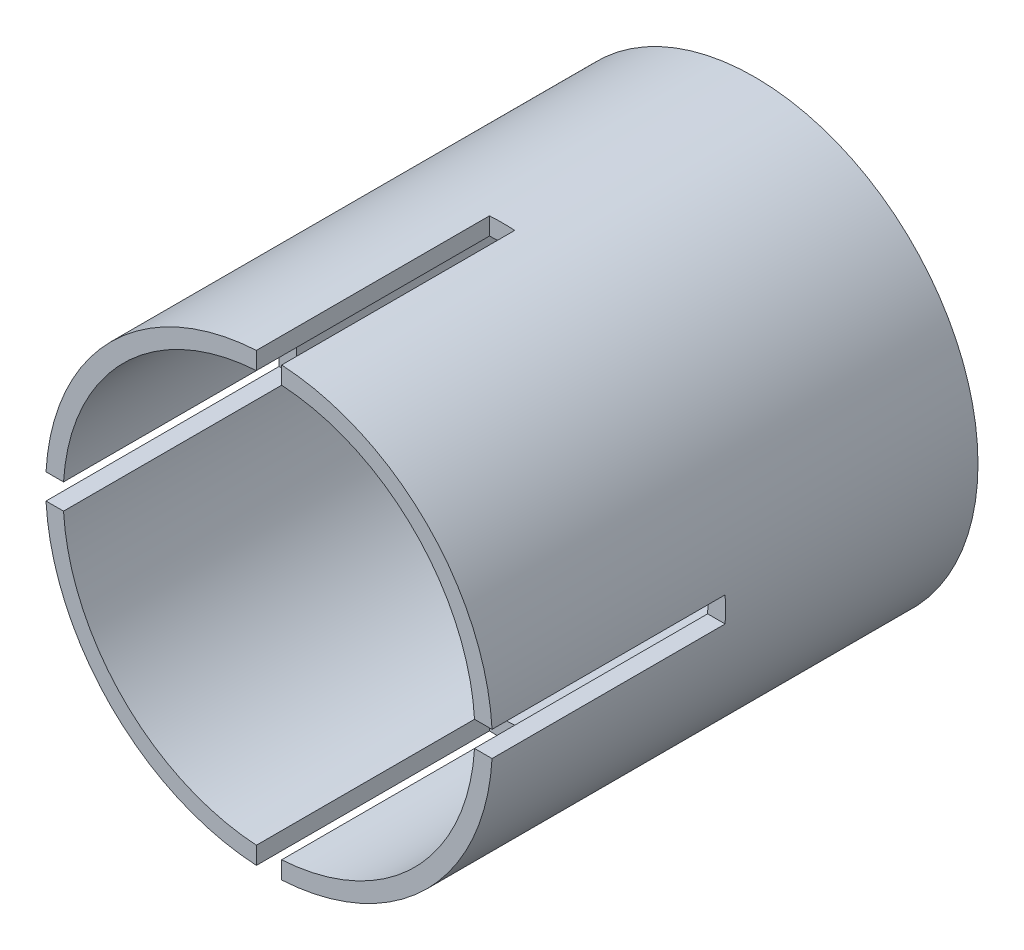
ISO-10303-21;
HEADER;
FILE_DESCRIPTION(('STEP AP214'),'2;1');
FILE_NAME('part.step','',(''),(''),'','','');
FILE_SCHEMA(('AUTOMOTIVE_DESIGN { 1 0 10303 214 1 1 1 1 }'));
ENDSEC;
DATA;
#1=APPLICATION_CONTEXT('core data for automotive mechanical design processes');
#2=APPLICATION_PROTOCOL_DEFINITION('international standard','automotive_design',2000,#1);
#3=PRODUCT_CONTEXT('',#1,'mechanical');
#4=PRODUCT('Part','Part','',(#3));
#5=PRODUCT_RELATED_PRODUCT_CATEGORY('part','',(#4));
#6=PRODUCT_DEFINITION_FORMATION('','',#4);
#7=PRODUCT_DEFINITION_CONTEXT('part definition',#1,'design');
#8=PRODUCT_DEFINITION('design','',#6,#7);
#9=PRODUCT_DEFINITION_SHAPE('','',#8);
#10=(LENGTH_UNIT() NAMED_UNIT(*) SI_UNIT(.MILLI.,.METRE.));
#11=(NAMED_UNIT(*) PLANE_ANGLE_UNIT() SI_UNIT($,.RADIAN.));
#12=(NAMED_UNIT(*) SI_UNIT($,.STERADIAN.) SOLID_ANGLE_UNIT());
#13=UNCERTAINTY_MEASURE_WITH_UNIT(LENGTH_MEASURE(1.E-05),#10,'distance_accuracy_value','');
#14=(GEOMETRIC_REPRESENTATION_CONTEXT(3) GLOBAL_UNCERTAINTY_ASSIGNED_CONTEXT((#13)) GLOBAL_UNIT_ASSIGNED_CONTEXT((#10,
#11,#12)) REPRESENTATION_CONTEXT('',''));
#15=CARTESIAN_POINT('',(0.,0.,0.));
#16=DIRECTION('',(0.,0.,1.));
#17=DIRECTION('',(1.,0.,0.));
#18=AXIS2_PLACEMENT_3D('',#15,#16,#17);
#19=CARTESIAN_POINT('',(0.,0.,25.));
#20=DIRECTION('',(0.,0.,1.));
#21=DIRECTION('',(1.,0.,0.));
#22=AXIS2_PLACEMENT_3D('',#19,#20,#21);
#23=PLANE('',#22);
#24=DIRECTION('',(0.,1.,0.));
#25=VECTOR('',#24,1.);
#26=CARTESIAN_POINT('',(0.650000000000136,-13.,25.));
#27=LINE('',#26,#25);
#28=CARTESIAN_POINT('',(0.65000000000012,-11.4816157399558,25.));
#29=VERTEX_POINT('',#28);
#30=CARTESIAN_POINT('',(0.650000000000111,-10.5800519847494,25.));
#31=VERTEX_POINT('',#30);
#32=EDGE_CURVE('E161',#29,#31,#27,.T.);
#33=ORIENTED_EDGE('',*,*,#32,.F.);
#34=CARTESIAN_POINT('',(0.,0.,25.));
#35=DIRECTION('',(0.,0.,1.));
#36=DIRECTION('',(1.,0.,0.));
#37=AXIS2_PLACEMENT_3D('',#34,#35,#36);
#38=CIRCLE('',#37,11.5);
#39=CARTESIAN_POINT('',(11.4816157399558,-0.65,25.));
#40=VERTEX_POINT('',#39);
#41=EDGE_CURVE('E185',#29,#40,#38,.T.);
#42=ORIENTED_EDGE('',*,*,#41,.T.);
#43=DIRECTION('',(1.,0.,0.));
#44=VECTOR('',#43,1.);
#45=CARTESIAN_POINT('',(13.,-0.65,25.));
#46=LINE('',#45,#44);
#47=CARTESIAN_POINT('',(10.5800519847494,-0.65,25.));
#48=VERTEX_POINT('',#47);
#49=EDGE_CURVE('E262',#48,#40,#46,.T.);
#50=ORIENTED_EDGE('',*,*,#49,.F.);
#51=CARTESIAN_POINT('',(0.,0.,25.));
#52=DIRECTION('',(0.,0.,1.));
#53=DIRECTION('',(1.,0.,0.));
#54=AXIS2_PLACEMENT_3D('',#51,#52,#53);
#55=CIRCLE('',#54,10.6);
#56=EDGE_CURVE('E170',#31,#48,#55,.T.);
#57=ORIENTED_EDGE('',*,*,#56,.F.);
#58=EDGE_LOOP('',(#33,#42,#50,#57));
#59=FACE_BOUND('',#58,.T.);
#60=ADVANCED_FACE('F31',(#59),#23,.T.);
#61=DIRECTION('',(0.,-1.,0.));
#62=VECTOR('',#61,1.);
#63=CARTESIAN_POINT('',(-0.649999999999864,-13.,25.));
#64=LINE('',#63,#62);
#65=CARTESIAN_POINT('',(-0.649999999999889,-10.5800519847494,25.));
#66=VERTEX_POINT('',#65);
#67=CARTESIAN_POINT('',(-0.64999999999988,-11.4816157399558,25.));
#68=VERTEX_POINT('',#67);
#69=EDGE_CURVE('E145',#66,#68,#64,.T.);
#70=ORIENTED_EDGE('',*,*,#69,.F.);
#71=CARTESIAN_POINT('',(-10.5800519847494,-0.65,25.));
#72=VERTEX_POINT('',#71);
#73=EDGE_CURVE('E158',#72,#66,#55,.T.);
#74=ORIENTED_EDGE('',*,*,#73,.F.);
#75=DIRECTION('',(1.,0.,0.));
#76=VECTOR('',#75,1.);
#77=CARTESIAN_POINT('',(-13.,-0.65,25.));
#78=LINE('',#77,#76);
#79=CARTESIAN_POINT('',(-11.4816157399558,-0.65,25.));
#80=VERTEX_POINT('',#79);
#81=EDGE_CURVE('E233',#80,#72,#78,.T.);
#82=ORIENTED_EDGE('',*,*,#81,.F.);
#83=EDGE_CURVE('E160',#80,#68,#38,.T.);
#84=ORIENTED_EDGE('',*,*,#83,.T.);
#85=EDGE_LOOP('',(#70,#74,#82,#84));
#86=FACE_BOUND('',#85,.T.);
#87=ADVANCED_FACE('F156',(#86),#23,.T.);
#88=DIRECTION('',(-1.,0.,0.));
#89=VECTOR('',#88,1.);
#90=CARTESIAN_POINT('',(-13.,0.65,25.));
#91=LINE('',#90,#89);
#92=CARTESIAN_POINT('',(-10.5800519847494,0.65,25.));
#93=VERTEX_POINT('',#92);
#94=CARTESIAN_POINT('',(-11.4816157399558,0.65,25.));
#95=VERTEX_POINT('',#94);
#96=EDGE_CURVE('E229',#93,#95,#91,.T.);
#97=ORIENTED_EDGE('',*,*,#96,.F.);
#98=CARTESIAN_POINT('',(-0.650000000000037,10.5800519847494,25.));
#99=VERTEX_POINT('',#98);
#100=EDGE_CURVE('E169',#99,#93,#55,.T.);
#101=ORIENTED_EDGE('',*,*,#100,.F.);
#102=DIRECTION('',(0.,-1.,0.));
#103=VECTOR('',#102,1.);
#104=CARTESIAN_POINT('',(-0.650000000000046,13.,25.));
#105=LINE('',#104,#103);
#106=CARTESIAN_POINT('',(-0.65000000000004,11.4816157399558,25.));
#107=VERTEX_POINT('',#106);
#108=EDGE_CURVE('E250',#107,#99,#105,.T.);
#109=ORIENTED_EDGE('',*,*,#108,.F.);
#110=EDGE_CURVE('E184',#107,#95,#38,.T.);
#111=ORIENTED_EDGE('',*,*,#110,.T.);
#112=EDGE_LOOP('',(#97,#101,#109,#111));
#113=FACE_BOUND('',#112,.T.);
#114=ADVANCED_FACE('F302',(#113),#23,.T.);
#115=DIRECTION('',(0.,1.,0.));
#116=VECTOR('',#115,1.);
#117=CARTESIAN_POINT('',(0.649999999999954,13.,25.));
#118=LINE('',#117,#116);
#119=CARTESIAN_POINT('',(0.649999999999963,10.5800519847494,25.));
#120=VERTEX_POINT('',#119);
#121=CARTESIAN_POINT('',(0.64999999999996,11.4816157399558,25.));
#122=VERTEX_POINT('',#121);
#123=EDGE_CURVE('E245',#120,#122,#118,.T.);
#124=ORIENTED_EDGE('',*,*,#123,.F.);
#125=CARTESIAN_POINT('',(10.5800519847494,0.65,25.));
#126=VERTEX_POINT('',#125);
#127=EDGE_CURVE('E173',#126,#120,#55,.T.);
#128=ORIENTED_EDGE('',*,*,#127,.F.);
#129=DIRECTION('',(-1.,0.,0.));
#130=VECTOR('',#129,1.);
#131=CARTESIAN_POINT('',(13.,0.65,25.));
#132=LINE('',#131,#130);
#133=CARTESIAN_POINT('',(11.4816157399558,0.65,25.));
#134=VERTEX_POINT('',#133);
#135=EDGE_CURVE('E267',#134,#126,#132,.T.);
#136=ORIENTED_EDGE('',*,*,#135,.F.);
#137=EDGE_CURVE('E180',#134,#122,#38,.T.);
#138=ORIENTED_EDGE('',*,*,#137,.T.);
#139=EDGE_LOOP('',(#124,#128,#136,#138));
#140=FACE_BOUND('',#139,.T.);
#141=ADVANCED_FACE('F286',(#140),#23,.T.);
#142=CARTESIAN_POINT('',(0.,0.,0.));
#143=DIRECTION('',(0.,0.,1.));
#144=DIRECTION('',(1.,0.,0.));
#145=AXIS2_PLACEMENT_3D('',#142,#143,#144);
#146=PLANE('',#145);
#147=CARTESIAN_POINT('',(0.,0.,0.));
#148=DIRECTION('',(0.,0.,1.));
#149=DIRECTION('',(1.,0.,0.));
#150=AXIS2_PLACEMENT_3D('',#147,#148,#149);
#151=CIRCLE('',#150,11.5);
#152=CARTESIAN_POINT('',(11.5,0.,0.));
#153=VERTEX_POINT('',#152);
#154=EDGE_CURVE('E178',#153,#153,#151,.T.);
#155=ORIENTED_EDGE('',*,*,#154,.F.);
#156=EDGE_LOOP('',(#155));
#157=FACE_BOUND('',#156,.T.);
#158=ADVANCED_FACE('F337',(#157),#146,.F.);
#159=CARTESIAN_POINT('',(0.,0.,25.));
#160=DIRECTION('',(0.,0.,-1.));
#161=DIRECTION('',(-1.,0.,0.));
#162=AXIS2_PLACEMENT_3D('',#159,#160,#161);
#163=CYLINDRICAL_SURFACE('',#162,11.5);
#164=ORIENTED_EDGE('',*,*,#41,.F.);
#165=DIRECTION('',(0.,0.,-1.));
#166=VECTOR('',#165,1.);
#167=CARTESIAN_POINT('',(0.65000000000012,-11.4816157399558,25.));
#168=LINE('',#167,#166);
#169=CARTESIAN_POINT('',(0.65000000000012,-11.4816157399558,13.));
#170=VERTEX_POINT('',#169);
#171=EDGE_CURVE('E222',#29,#170,#168,.T.);
#172=ORIENTED_EDGE('',*,*,#171,.T.);
#173=CARTESIAN_POINT('',(0.,0.,13.));
#174=DIRECTION('',(0.,0.,1.));
#175=DIRECTION('',(1.,0.,0.));
#176=AXIS2_PLACEMENT_3D('',#173,#174,#175);
#177=CIRCLE('',#176,11.5);
#178=CARTESIAN_POINT('',(-0.64999999999988,-11.4816157399558,13.));
#179=VERTEX_POINT('',#178);
#180=EDGE_CURVE('E215',#179,#170,#177,.T.);
#181=ORIENTED_EDGE('',*,*,#180,.F.);
#182=DIRECTION('',(0.,0.,-1.));
#183=VECTOR('',#182,1.);
#184=CARTESIAN_POINT('',(-0.64999999999988,-11.4816157399558,25.));
#185=LINE('',#184,#183);
#186=EDGE_CURVE('E221',#179,#68,#185,.F.);
#187=ORIENTED_EDGE('',*,*,#186,.T.);
#188=ORIENTED_EDGE('',*,*,#83,.F.);
#189=DIRECTION('',(0.,0.,-1.));
#190=VECTOR('',#189,1.);
#191=CARTESIAN_POINT('',(-11.4816157399558,-0.65,25.));
#192=LINE('',#191,#190);
#193=CARTESIAN_POINT('',(-11.4816157399558,-0.65,13.));
#194=VERTEX_POINT('',#193);
#195=EDGE_CURVE('E242',#80,#194,#192,.T.);
#196=ORIENTED_EDGE('',*,*,#195,.T.);
#197=CARTESIAN_POINT('',(0.,0.,13.));
#198=DIRECTION('',(0.,0.,1.));
#199=DIRECTION('',(1.,0.,0.));
#200=AXIS2_PLACEMENT_3D('',#197,#198,#199);
#201=CIRCLE('',#200,11.5);
#202=CARTESIAN_POINT('',(-11.4816157399558,0.65,13.));
#203=VERTEX_POINT('',#202);
#204=EDGE_CURVE('E235',#203,#194,#201,.T.);
#205=ORIENTED_EDGE('',*,*,#204,.F.);
#206=DIRECTION('',(0.,0.,-1.));
#207=VECTOR('',#206,1.);
#208=CARTESIAN_POINT('',(-11.4816157399558,0.65,25.));
#209=LINE('',#208,#207);
#210=EDGE_CURVE('E239',#203,#95,#209,.F.);
#211=ORIENTED_EDGE('',*,*,#210,.T.);
#212=ORIENTED_EDGE('',*,*,#110,.F.);
#213=DIRECTION('',(0.,0.,-1.));
#214=VECTOR('',#213,1.);
#215=CARTESIAN_POINT('',(-0.65000000000004,11.4816157399558,25.));
#216=LINE('',#215,#214);
#217=CARTESIAN_POINT('',(-0.65000000000004,11.4816157399558,13.));
#218=VERTEX_POINT('',#217);
#219=EDGE_CURVE('E259',#107,#218,#216,.T.);
#220=ORIENTED_EDGE('',*,*,#219,.T.);
#221=CARTESIAN_POINT('',(0.,0.,13.));
#222=DIRECTION('',(0.,0.,1.));
#223=DIRECTION('',(1.,0.,0.));
#224=AXIS2_PLACEMENT_3D('',#221,#222,#223);
#225=CIRCLE('',#224,11.5);
#226=CARTESIAN_POINT('',(0.64999999999996,11.4816157399558,13.));
#227=VERTEX_POINT('',#226);
#228=EDGE_CURVE('E252',#227,#218,#225,.T.);
#229=ORIENTED_EDGE('',*,*,#228,.F.);
#230=DIRECTION('',(0.,0.,-1.));
#231=VECTOR('',#230,1.);
#232=CARTESIAN_POINT('',(0.64999999999996,11.4816157399558,25.));
#233=LINE('',#232,#231);
#234=EDGE_CURVE('E256',#227,#122,#233,.F.);
#235=ORIENTED_EDGE('',*,*,#234,.T.);
#236=ORIENTED_EDGE('',*,*,#137,.F.);
#237=DIRECTION('',(0.,0.,-1.));
#238=VECTOR('',#237,1.);
#239=CARTESIAN_POINT('',(11.4816157399558,0.65,25.));
#240=LINE('',#239,#238);
#241=CARTESIAN_POINT('',(11.4816157399558,0.65,13.));
#242=VERTEX_POINT('',#241);
#243=EDGE_CURVE('E174',#134,#242,#240,.T.);
#244=ORIENTED_EDGE('',*,*,#243,.T.);
#245=CARTESIAN_POINT('',(0.,0.,13.));
#246=DIRECTION('',(0.,0.,1.));
#247=DIRECTION('',(1.,0.,0.));
#248=AXIS2_PLACEMENT_3D('',#245,#246,#247);
#249=CIRCLE('',#248,11.5);
#250=CARTESIAN_POINT('',(11.4816157399558,-0.65,13.));
#251=VERTEX_POINT('',#250);
#252=EDGE_CURVE('E269',#251,#242,#249,.T.);
#253=ORIENTED_EDGE('',*,*,#252,.F.);
#254=DIRECTION('',(0.,0.,-1.));
#255=VECTOR('',#254,1.);
#256=CARTESIAN_POINT('',(11.4816157399558,-0.65,25.));
#257=LINE('',#256,#255);
#258=EDGE_CURVE('E273',#251,#40,#257,.F.);
#259=ORIENTED_EDGE('',*,*,#258,.T.);
#260=EDGE_LOOP('',(#164,#172,#181,#187,#188,#196,#205,#211,#212,#220,#229,#235,#236,#244,#253,#259));
#261=FACE_BOUND('',#260,.T.);
#262=ORIENTED_EDGE('',*,*,#154,.T.);
#263=EDGE_LOOP('',(#262));
#264=FACE_BOUND('',#263,.T.);
#265=ADVANCED_FACE('F33',(#261,#264),#163,.T.);
#266=CARTESIAN_POINT('',(0.,0.,25.));
#267=DIRECTION('',(0.,0.,-1.));
#268=DIRECTION('',(-1.,0.,0.));
#269=AXIS2_PLACEMENT_3D('',#266,#267,#268);
#270=CYLINDRICAL_SURFACE('',#269,10.6);
#271=DIRECTION('',(0.,0.,-1.));
#272=VECTOR('',#271,1.);
#273=CARTESIAN_POINT('',(0.650000000000111,-10.5800519847494,25.));
#274=LINE('',#273,#272);
#275=CARTESIAN_POINT('',(0.650000000000111,-10.5800519847494,13.));
#276=VERTEX_POINT('',#275);
#277=EDGE_CURVE('E11',#31,#276,#274,.T.);
#278=ORIENTED_EDGE('',*,*,#277,.F.);
#279=ORIENTED_EDGE('',*,*,#56,.T.);
#280=DIRECTION('',(0.,0.,-1.));
#281=VECTOR('',#280,1.);
#282=CARTESIAN_POINT('',(10.5800519847494,-0.65,25.));
#283=LINE('',#282,#281);
#284=CARTESIAN_POINT('',(10.5800519847494,-0.65,13.));
#285=VERTEX_POINT('',#284);
#286=EDGE_CURVE('E193',#285,#48,#283,.F.);
#287=ORIENTED_EDGE('',*,*,#286,.F.);
#288=CARTESIAN_POINT('',(0.,0.,13.));
#289=DIRECTION('',(0.,0.,1.));
#290=DIRECTION('',(1.,0.,0.));
#291=AXIS2_PLACEMENT_3D('',#288,#289,#290);
#292=CIRCLE('',#291,10.6);
#293=CARTESIAN_POINT('',(10.5800519847494,0.65,13.));
#294=VERTEX_POINT('',#293);
#295=EDGE_CURVE('E190',#285,#294,#292,.T.);
#296=ORIENTED_EDGE('',*,*,#295,.T.);
#297=DIRECTION('',(0.,0.,-1.));
#298=VECTOR('',#297,1.);
#299=CARTESIAN_POINT('',(10.5800519847494,0.65,25.));
#300=LINE('',#299,#298);
#301=EDGE_CURVE('E196',#126,#294,#300,.T.);
#302=ORIENTED_EDGE('',*,*,#301,.F.);
#303=ORIENTED_EDGE('',*,*,#127,.T.);
#304=DIRECTION('',(0.,0.,-1.));
#305=VECTOR('',#304,1.);
#306=CARTESIAN_POINT('',(0.649999999999963,10.5800519847494,25.));
#307=LINE('',#306,#305);
#308=CARTESIAN_POINT('',(0.649999999999963,10.5800519847494,13.));
#309=VERTEX_POINT('',#308);
#310=EDGE_CURVE('E202',#309,#120,#307,.F.);
#311=ORIENTED_EDGE('',*,*,#310,.F.);
#312=CARTESIAN_POINT('',(0.,0.,13.));
#313=DIRECTION('',(0.,0.,1.));
#314=DIRECTION('',(1.,0.,0.));
#315=AXIS2_PLACEMENT_3D('',#312,#313,#314);
#316=CIRCLE('',#315,10.6);
#317=CARTESIAN_POINT('',(-0.650000000000037,10.5800519847494,13.));
#318=VERTEX_POINT('',#317);
#319=EDGE_CURVE('E199',#309,#318,#316,.T.);
#320=ORIENTED_EDGE('',*,*,#319,.T.);
#321=DIRECTION('',(0.,0.,-1.));
#322=VECTOR('',#321,1.);
#323=CARTESIAN_POINT('',(-0.650000000000037,10.5800519847494,25.));
#324=LINE('',#323,#322);
#325=EDGE_CURVE('E204',#99,#318,#324,.T.);
#326=ORIENTED_EDGE('',*,*,#325,.F.);
#327=ORIENTED_EDGE('',*,*,#100,.T.);
#328=DIRECTION('',(0.,0.,-1.));
#329=VECTOR('',#328,1.);
#330=CARTESIAN_POINT('',(-10.5800519847494,0.65,25.));
#331=LINE('',#330,#329);
#332=CARTESIAN_POINT('',(-10.5800519847494,0.65,13.));
#333=VERTEX_POINT('',#332);
#334=EDGE_CURVE('E209',#333,#93,#331,.F.);
#335=ORIENTED_EDGE('',*,*,#334,.F.);
#336=CARTESIAN_POINT('',(0.,0.,13.));
#337=DIRECTION('',(0.,0.,1.));
#338=DIRECTION('',(1.,0.,0.));
#339=AXIS2_PLACEMENT_3D('',#336,#337,#338);
#340=CIRCLE('',#339,10.6);
#341=CARTESIAN_POINT('',(-10.5800519847494,-0.65,13.));
#342=VERTEX_POINT('',#341);
#343=EDGE_CURVE('E207',#333,#342,#340,.T.);
#344=ORIENTED_EDGE('',*,*,#343,.T.);
#345=DIRECTION('',(0.,0.,-1.));
#346=VECTOR('',#345,1.);
#347=CARTESIAN_POINT('',(-10.5800519847494,-0.65,25.));
#348=LINE('',#347,#346);
#349=EDGE_CURVE('E168',#72,#342,#348,.T.);
#350=ORIENTED_EDGE('',*,*,#349,.F.);
#351=ORIENTED_EDGE('',*,*,#73,.T.);
#352=DIRECTION('',(0.,0.,-1.));
#353=VECTOR('',#352,1.);
#354=CARTESIAN_POINT('',(-0.649999999999889,-10.5800519847494,25.));
#355=LINE('',#354,#353);
#356=CARTESIAN_POINT('',(-0.649999999999889,-10.5800519847494,13.));
#357=VERTEX_POINT('',#356);
#358=EDGE_CURVE('E39',#357,#66,#355,.F.);
#359=ORIENTED_EDGE('',*,*,#358,.F.);
#360=CARTESIAN_POINT('',(0.,0.,13.));
#361=DIRECTION('',(0.,0.,1.));
#362=DIRECTION('',(1.,0.,0.));
#363=AXIS2_PLACEMENT_3D('',#360,#361,#362);
#364=CIRCLE('',#363,10.6);
#365=EDGE_CURVE('E152',#357,#276,#364,.T.);
#366=ORIENTED_EDGE('',*,*,#365,.T.);
#367=EDGE_LOOP('',(#278,#279,#287,#296,#302,#303,#311,#320,#326,#327,#335,#344,#350,#351,#359,#366));
#368=FACE_BOUND('',#367,.T.);
#369=CARTESIAN_POINT('',(0.,0.,1.));
#370=DIRECTION('',(0.,0.,1.));
#371=DIRECTION('',(1.,0.,0.));
#372=AXIS2_PLACEMENT_3D('',#369,#370,#371);
#373=CIRCLE('',#372,10.6);
#374=CARTESIAN_POINT('',(10.6,0.,1.));
#375=VERTEX_POINT('',#374);
#376=EDGE_CURVE('E183',#375,#375,#373,.T.);
#377=ORIENTED_EDGE('',*,*,#376,.F.);
#378=EDGE_LOOP('',(#377));
#379=FACE_BOUND('',#378,.T.);
#380=ADVANCED_FACE('F165',(#368,#379),#270,.F.);
#381=CARTESIAN_POINT('',(0.,0.,1.));
#382=DIRECTION('',(0.,0.,1.));
#383=DIRECTION('',(1.,0.,0.));
#384=AXIS2_PLACEMENT_3D('',#381,#382,#383);
#385=PLANE('',#384);
#386=ORIENTED_EDGE('',*,*,#376,.T.);
#387=EDGE_LOOP('',(#386));
#388=FACE_BOUND('',#387,.T.);
#389=ADVANCED_FACE('F378',(#388),#385,.T.);
#390=CARTESIAN_POINT('',(13.,0.65,13.));
#391=DIRECTION('',(0.,1.,0.));
#392=DIRECTION('',(-1.,0.,0.));
#393=AXIS2_PLACEMENT_3D('',#390,#391,#392);
#394=PLANE('',#393);
#395=ORIENTED_EDGE('',*,*,#135,.T.);
#396=ORIENTED_EDGE('',*,*,#301,.T.);
#397=DIRECTION('',(-1.,0.,0.));
#398=VECTOR('',#397,1.);
#399=CARTESIAN_POINT('',(13.,0.65,13.));
#400=LINE('',#399,#398);
#401=EDGE_CURVE('E266',#242,#294,#400,.T.);
#402=ORIENTED_EDGE('',*,*,#401,.F.);
#403=ORIENTED_EDGE('',*,*,#243,.F.);
#404=EDGE_LOOP('',(#395,#396,#402,#403));
#405=FACE_BOUND('',#404,.T.);
#406=ADVANCED_FACE('F281',(#405),#394,.F.);
#407=CARTESIAN_POINT('',(13.,-0.65,13.));
#408=DIRECTION('',(0.,-1.,0.));
#409=DIRECTION('',(1.,0.,0.));
#410=AXIS2_PLACEMENT_3D('',#407,#408,#409);
#411=PLANE('',#410);
#412=DIRECTION('',(1.,0.,0.));
#413=VECTOR('',#412,1.);
#414=CARTESIAN_POINT('',(13.,-0.65,13.));
#415=LINE('',#414,#413);
#416=EDGE_CURVE('E263',#285,#251,#415,.T.);
#417=ORIENTED_EDGE('',*,*,#416,.F.);
#418=ORIENTED_EDGE('',*,*,#286,.T.);
#419=ORIENTED_EDGE('',*,*,#49,.T.);
#420=ORIENTED_EDGE('',*,*,#258,.F.);
#421=EDGE_LOOP('',(#417,#418,#419,#420));
#422=FACE_BOUND('',#421,.T.);
#423=ADVANCED_FACE('F293',(#422),#411,.F.);
#424=CARTESIAN_POINT('',(10.,0.65,13.));
#425=DIRECTION('',(0.,0.,1.));
#426=DIRECTION('',(1.,0.,0.));
#427=AXIS2_PLACEMENT_3D('',#424,#425,#426);
#428=PLANE('',#427);
#429=ORIENTED_EDGE('',*,*,#252,.T.);
#430=ORIENTED_EDGE('',*,*,#401,.T.);
#431=ORIENTED_EDGE('',*,*,#295,.F.);
#432=ORIENTED_EDGE('',*,*,#416,.T.);
#433=EDGE_LOOP('',(#429,#430,#431,#432));
#434=FACE_BOUND('',#433,.T.);
#435=ADVANCED_FACE('F291',(#434),#428,.T.);
#436=CARTESIAN_POINT('',(-0.650000000000046,13.,13.));
#437=DIRECTION('',(-1.,0.,0.));
#438=DIRECTION('',(0.,-1.,0.));
#439=AXIS2_PLACEMENT_3D('',#436,#437,#438);
#440=PLANE('',#439);
#441=ORIENTED_EDGE('',*,*,#108,.T.);
#442=ORIENTED_EDGE('',*,*,#325,.T.);
#443=DIRECTION('',(0.,-1.,0.));
#444=VECTOR('',#443,1.);
#445=CARTESIAN_POINT('',(-0.650000000000046,13.,13.));
#446=LINE('',#445,#444);
#447=EDGE_CURVE('E249',#218,#318,#446,.T.);
#448=ORIENTED_EDGE('',*,*,#447,.F.);
#449=ORIENTED_EDGE('',*,*,#219,.F.);
#450=EDGE_LOOP('',(#441,#442,#448,#449));
#451=FACE_BOUND('',#450,.T.);
#452=ADVANCED_FACE('F314',(#451),#440,.F.);
#453=CARTESIAN_POINT('',(0.649999999999954,13.,13.));
#454=DIRECTION('',(1.,0.,0.));
#455=DIRECTION('',(0.,1.,0.));
#456=AXIS2_PLACEMENT_3D('',#453,#454,#455);
#457=PLANE('',#456);
#458=DIRECTION('',(0.,1.,0.));
#459=VECTOR('',#458,1.);
#460=CARTESIAN_POINT('',(0.649999999999954,13.,13.));
#461=LINE('',#460,#459);
#462=EDGE_CURVE('E246',#309,#227,#461,.T.);
#463=ORIENTED_EDGE('',*,*,#462,.F.);
#464=ORIENTED_EDGE('',*,*,#310,.T.);
#465=ORIENTED_EDGE('',*,*,#123,.T.);
#466=ORIENTED_EDGE('',*,*,#234,.F.);
#467=EDGE_LOOP('',(#463,#464,#465,#466));
#468=FACE_BOUND('',#467,.T.);
#469=ADVANCED_FACE('F319',(#468),#457,.F.);
#470=CARTESIAN_POINT('',(-0.650000000000035,10.,13.));
#471=DIRECTION('',(0.,0.,1.));
#472=DIRECTION('',(0.,1.,0.));
#473=AXIS2_PLACEMENT_3D('',#470,#471,#472);
#474=PLANE('',#473);
#475=ORIENTED_EDGE('',*,*,#228,.T.);
#476=ORIENTED_EDGE('',*,*,#447,.T.);
#477=ORIENTED_EDGE('',*,*,#319,.F.);
#478=ORIENTED_EDGE('',*,*,#462,.T.);
#479=EDGE_LOOP('',(#475,#476,#477,#478));
#480=FACE_BOUND('',#479,.T.);
#481=ADVANCED_FACE('F316',(#480),#474,.T.);
#482=CARTESIAN_POINT('',(-13.,-0.65,13.));
#483=DIRECTION('',(0.,-1.,0.));
#484=DIRECTION('',(1.,0.,0.));
#485=AXIS2_PLACEMENT_3D('',#482,#483,#484);
#486=PLANE('',#485);
#487=ORIENTED_EDGE('',*,*,#81,.T.);
#488=ORIENTED_EDGE('',*,*,#349,.T.);
#489=DIRECTION('',(1.,0.,0.));
#490=VECTOR('',#489,1.);
#491=CARTESIAN_POINT('',(-13.,-0.65,13.));
#492=LINE('',#491,#490);
#493=EDGE_CURVE('E53',#194,#342,#492,.T.);
#494=ORIENTED_EDGE('',*,*,#493,.F.);
#495=ORIENTED_EDGE('',*,*,#195,.F.);
#496=EDGE_LOOP('',(#487,#488,#494,#495));
#497=FACE_BOUND('',#496,.T.);
#498=ADVANCED_FACE('F326',(#497),#486,.F.);
#499=CARTESIAN_POINT('',(-13.,0.65,13.));
#500=DIRECTION('',(0.,1.,0.));
#501=DIRECTION('',(-1.,0.,0.));
#502=AXIS2_PLACEMENT_3D('',#499,#500,#501);
#503=PLANE('',#502);
#504=DIRECTION('',(-1.,0.,0.));
#505=VECTOR('',#504,1.);
#506=CARTESIAN_POINT('',(-13.,0.65,13.));
#507=LINE('',#506,#505);
#508=EDGE_CURVE('E230',#333,#203,#507,.T.);
#509=ORIENTED_EDGE('',*,*,#508,.F.);
#510=ORIENTED_EDGE('',*,*,#334,.T.);
#511=ORIENTED_EDGE('',*,*,#96,.T.);
#512=ORIENTED_EDGE('',*,*,#210,.F.);
#513=EDGE_LOOP('',(#509,#510,#511,#512));
#514=FACE_BOUND('',#513,.T.);
#515=ADVANCED_FACE('F308',(#514),#503,.F.);
#516=CARTESIAN_POINT('',(-10.,-0.65,13.));
#517=DIRECTION('',(0.,0.,1.));
#518=DIRECTION('',(-1.,0.,0.));
#519=AXIS2_PLACEMENT_3D('',#516,#517,#518);
#520=PLANE('',#519);
#521=ORIENTED_EDGE('',*,*,#204,.T.);
#522=ORIENTED_EDGE('',*,*,#493,.T.);
#523=ORIENTED_EDGE('',*,*,#343,.F.);
#524=ORIENTED_EDGE('',*,*,#508,.T.);
#525=EDGE_LOOP('',(#521,#522,#523,#524));
#526=FACE_BOUND('',#525,.T.);
#527=ADVANCED_FACE('F310',(#526),#520,.T.);
#528=CARTESIAN_POINT('',(0.650000000000136,-13.,13.));
#529=DIRECTION('',(1.,0.,0.));
#530=DIRECTION('',(0.,1.,0.));
#531=AXIS2_PLACEMENT_3D('',#528,#529,#530);
#532=PLANE('',#531);
#533=ORIENTED_EDGE('',*,*,#32,.T.);
#534=ORIENTED_EDGE('',*,*,#277,.T.);
#535=DIRECTION('',(0.,1.,0.));
#536=VECTOR('',#535,1.);
#537=CARTESIAN_POINT('',(0.650000000000136,-13.,13.));
#538=LINE('',#537,#536);
#539=EDGE_CURVE('E46',#170,#276,#538,.T.);
#540=ORIENTED_EDGE('',*,*,#539,.F.);
#541=ORIENTED_EDGE('',*,*,#171,.F.);
#542=EDGE_LOOP('',(#533,#534,#540,#541));
#543=FACE_BOUND('',#542,.T.);
#544=ADVANCED_FACE('F447',(#543),#532,.F.);
#545=CARTESIAN_POINT('',(-0.649999999999864,-13.,13.));
#546=DIRECTION('',(-1.,0.,0.));
#547=DIRECTION('',(0.,-1.,0.));
#548=AXIS2_PLACEMENT_3D('',#545,#546,#547);
#549=PLANE('',#548);
#550=DIRECTION('',(0.,-1.,0.));
#551=VECTOR('',#550,1.);
#552=CARTESIAN_POINT('',(-0.649999999999864,-13.,13.));
#553=LINE('',#552,#551);
#554=EDGE_CURVE('E148',#357,#179,#553,.T.);
#555=ORIENTED_EDGE('',*,*,#554,.F.);
#556=ORIENTED_EDGE('',*,*,#358,.T.);
#557=ORIENTED_EDGE('',*,*,#69,.T.);
#558=ORIENTED_EDGE('',*,*,#186,.F.);
#559=EDGE_LOOP('',(#555,#556,#557,#558));
#560=FACE_BOUND('',#559,.T.);
#561=ADVANCED_FACE('F144',(#560),#549,.F.);
#562=CARTESIAN_POINT('',(0.650000000000105,-9.99999999999999,13.));
#563=DIRECTION('',(0.,0.,1.));
#564=DIRECTION('',(0.,-1.,0.));
#565=AXIS2_PLACEMENT_3D('',#562,#563,#564);
#566=PLANE('',#565);
#567=ORIENTED_EDGE('',*,*,#180,.T.);
#568=ORIENTED_EDGE('',*,*,#539,.T.);
#569=ORIENTED_EDGE('',*,*,#365,.F.);
#570=ORIENTED_EDGE('',*,*,#554,.T.);
#571=EDGE_LOOP('',(#567,#568,#569,#570));
#572=FACE_BOUND('',#571,.T.);
#573=ADVANCED_FACE('F213',(#572),#566,.T.);
#574=CLOSED_SHELL('',(#60,#87,#114,#141,#158,#265,#380,#389,#406,#423,#435,#452,#469,#481,#498,
#515,#527,#544,#561,#573));
#575=MANIFOLD_SOLID_BREP('B2',#574);
#576=ADVANCED_BREP_SHAPE_REPRESENTATION('',(#18,#575),#14);
#577=SHAPE_DEFINITION_REPRESENTATION(#9,#576);
ENDSEC;
END-ISO-10303-21;
